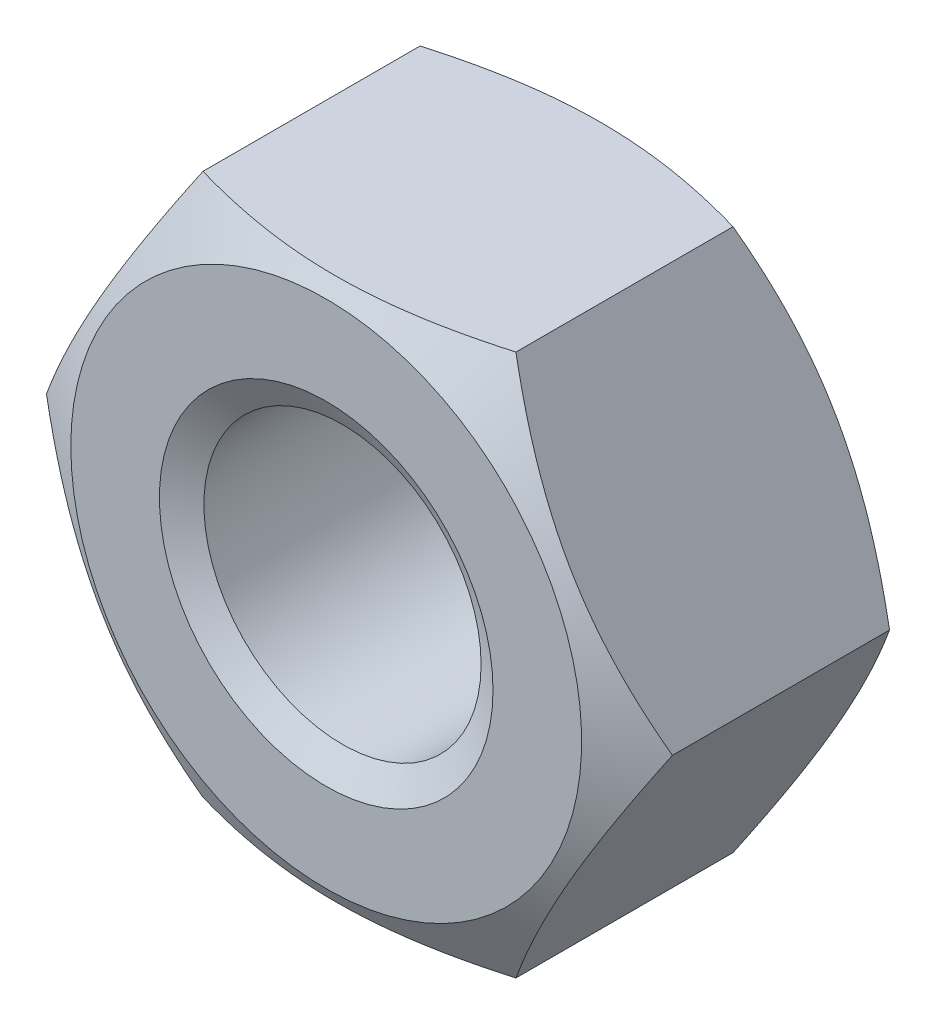
ISO-10303-21;
HEADER;
FILE_DESCRIPTION(('STEP AP214'),'2;1');
FILE_NAME('part.step','',(''),(''),'','','');
FILE_SCHEMA(('AUTOMOTIVE_DESIGN { 1 0 10303 214 1 1 1 1 }'));
ENDSEC;
DATA;
#1=APPLICATION_CONTEXT('core data for automotive mechanical design processes');
#2=APPLICATION_PROTOCOL_DEFINITION('international standard','automotive_design',2000,#1);
#3=PRODUCT_CONTEXT('',#1,'mechanical');
#4=PRODUCT('Part','Part','',(#3));
#5=PRODUCT_RELATED_PRODUCT_CATEGORY('part','',(#4));
#6=PRODUCT_DEFINITION_FORMATION('','',#4);
#7=PRODUCT_DEFINITION_CONTEXT('part definition',#1,'design');
#8=PRODUCT_DEFINITION('design','',#6,#7);
#9=PRODUCT_DEFINITION_SHAPE('','',#8);
#10=(LENGTH_UNIT() NAMED_UNIT(*) SI_UNIT(.MILLI.,.METRE.));
#11=(NAMED_UNIT(*) PLANE_ANGLE_UNIT() SI_UNIT($,.RADIAN.));
#12=(NAMED_UNIT(*) SI_UNIT($,.STERADIAN.) SOLID_ANGLE_UNIT());
#13=UNCERTAINTY_MEASURE_WITH_UNIT(LENGTH_MEASURE(1.E-05),#10,'distance_accuracy_value','');
#14=(GEOMETRIC_REPRESENTATION_CONTEXT(3) GLOBAL_UNCERTAINTY_ASSIGNED_CONTEXT((#13)) GLOBAL_UNIT_ASSIGNED_CONTEXT((#10,
#11,#12)) REPRESENTATION_CONTEXT('',''));
#15=CARTESIAN_POINT('',(0.,0.,0.));
#16=DIRECTION('',(0.,0.,1.));
#17=DIRECTION('',(1.,0.,0.));
#18=AXIS2_PLACEMENT_3D('',#15,#16,#17);
#19=CARTESIAN_POINT('',(3.75277674973258,-6.5,-6.8));
#20=DIRECTION('',(0.866025403784439,-0.5,0.));
#21=DIRECTION('',(0.5,0.866025403784439,0.));
#22=AXIS2_PLACEMENT_3D('',#19,#20,#21);
#23=PLANE('',#22);
#24=CARTESIAN_POINT('',(3.75266127967874,-6.5002,-0.797129602751971));
#25=CARTESIAN_POINT('',(3.83515161912751,-6.35732254094112,-0.74951077402159));
#26=CARTESIAN_POINT('',(3.91794952254313,-6.21391236546508,-0.704053051548811));
#27=CARTESIAN_POINT('',(4.08421773795795,-5.9259273686828,-0.618055032969151));
#28=CARTESIAN_POINT('',(4.16768832359106,-5.78135207342873,-0.577516858174131));
#29=CARTESIAN_POINT('',(4.41943655294052,-5.34531134947996,-0.464077352069315));
#30=CARTESIAN_POINT('',(4.5887079340369,-5.05212471715368,-0.399554158074847));
#31=CARTESIAN_POINT('',(4.84201947708216,-4.61337625445562,-0.3238929344936));
#32=CARTESIAN_POINT('',(4.92530276780317,-4.46912536350531,-0.302339207403096));
#33=CARTESIAN_POINT('',(5.09224566542478,-4.17997178286191,-0.266196665552228));
#34=CARTESIAN_POINT('',(5.17590523841628,-4.03506915190111,-0.251607235405776));
#35=CARTESIAN_POINT('',(5.34336968579964,-3.74501222057168,-0.229765103453457));
#36=CARTESIAN_POINT('',(5.42717428667601,-3.59985839394579,-0.222504075268218));
#37=CARTESIAN_POINT('',(5.59485627940484,-3.30942466302505,-0.215466653528341));
#38=CARTESIAN_POINT('',(5.67873366892861,-3.16414476276364,-0.215690028758315));
#39=CARTESIAN_POINT('',(5.90853103021318,-2.7661240575735,-0.226589809461276));
#40=CARTESIAN_POINT('',(6.05437578112764,-2.51351353897243,-0.244888168815523));
#41=CARTESIAN_POINT('',(6.34509659313135,-2.00997032176432,-0.302912692403784));
#42=CARTESIAN_POINT('',(6.48997163178545,-1.75903939406692,-0.342658689484354));
#43=CARTESIAN_POINT('',(6.78127752911039,-1.25448277935568,-0.442012254148258));
#44=CARTESIAN_POINT('',(6.92767163007068,-1.00092075856409,-0.502040776584135));
#45=CARTESIAN_POINT('',(7.21827667013277,-0.497578064240956,-0.638281343455976));
#46=CARTESIAN_POINT('',(7.36249133098589,-0.247790944447037,-0.7144613851097));
#47=CARTESIAN_POINT('',(7.50566896951898,0.000199999999998428,-0.797129602751974));
#48=B_SPLINE_CURVE_WITH_KNOTS('',3,(#24,#25,#26,#27,#28,#29,#30,#31,#32,#33,#34,#35,#36,#37,#38,
#39,#40,#41,#42,#43,#44,#45,#46,#47),.UNSPECIFIED.,.F.,.F.,(4,2,2,2,2,2,2,2,2,2,2,4),(0.,
0.515105052395588,1.03043143507524,2.06322554824262,2.56697389547996,3.07067772176453,
3.57380860368928,4.0769239424252,4.9527935470566,5.82947446853466,6.72559912449736,
7.61996451221045),.UNSPECIFIED.);
#49=CARTESIAN_POINT('',(3.75277674973257,-6.5,-0.797062934546865));
#50=VERTEX_POINT('',#49);
#51=CARTESIAN_POINT('',(7.50555349946514,0.,-0.797062934546865));
#52=VERTEX_POINT('',#51);
#53=EDGE_CURVE('E50',#50,#52,#48,.T.);
#54=ORIENTED_EDGE('',*,*,#53,.F.);
#55=DIRECTION('',(0.,0.,1.));
#56=VECTOR('',#55,1.);
#57=CARTESIAN_POINT('',(3.75277674973258,-6.5,-6.8));
#58=LINE('',#57,#56);
#59=CARTESIAN_POINT('',(3.75277674973257,-6.5,-6.00293706545314));
#60=VERTEX_POINT('',#59);
#61=EDGE_CURVE('E114',#60,#50,#58,.T.);
#62=ORIENTED_EDGE('',*,*,#61,.F.);
#63=CARTESIAN_POINT('',(7.50566896951898,0.000199999999998263,-6.00287039724803));
#64=CARTESIAN_POINT('',(7.4231786300702,-0.142677459058882,-6.05048922597841));
#65=CARTESIAN_POINT('',(7.34038072665459,-0.286087634534915,-6.09594694845119));
#66=CARTESIAN_POINT('',(7.17411251123976,-0.574072631317197,-6.18194496703085));
#67=CARTESIAN_POINT('',(7.09064192560665,-0.718647926571265,-6.22248314182587));
#68=CARTESIAN_POINT('',(6.83889369625719,-1.15468865052003,-6.33592264793068));
#69=CARTESIAN_POINT('',(6.66962231516081,-1.44787528284632,-6.40044584192515));
#70=CARTESIAN_POINT('',(6.41631077211556,-1.88662374554438,-6.4761070655064));
#71=CARTESIAN_POINT('',(6.33302748139455,-2.03087463649469,-6.4976607925969));
#72=CARTESIAN_POINT('',(6.16608458377294,-2.32002821713809,-6.53380333444777));
#73=CARTESIAN_POINT('',(6.08242501078143,-2.46493084809889,-6.54839276459422));
#74=CARTESIAN_POINT('',(5.91496056339807,-2.75498777942832,-6.57023489654654));
#75=CARTESIAN_POINT('',(5.83115596252171,-2.90014160605421,-6.57749592473178));
#76=CARTESIAN_POINT('',(5.66347396979287,-3.19057533697495,-6.58453334647166));
#77=CARTESIAN_POINT('',(5.57959658026911,-3.33585523723636,-6.58430997124169));
#78=CARTESIAN_POINT('',(5.34979921898454,-3.7338759424265,-6.57341019053872));
#79=CARTESIAN_POINT('',(5.20395446807007,-3.98648646102757,-6.55511183118448));
#80=CARTESIAN_POINT('',(4.91323365606636,-4.49002967823568,-6.49708730759622));
#81=CARTESIAN_POINT('',(4.76835861741226,-4.74096060593308,-6.45734131051565));
#82=CARTESIAN_POINT('',(4.47705272008732,-5.24551722064432,-6.35798774585174));
#83=CARTESIAN_POINT('',(4.33065861912703,-5.49907924143591,-6.29795922341587));
#84=CARTESIAN_POINT('',(4.04005357906494,-6.00242193575904,-6.16171865654403));
#85=CARTESIAN_POINT('',(3.89583891821182,-6.25220905555296,-6.0855386148903));
#86=CARTESIAN_POINT('',(3.75266127967874,-6.5002,-6.00287039724803));
#87=B_SPLINE_CURVE_WITH_KNOTS('',3,(#63,#64,#65,#66,#67,#68,#69,#70,#71,#72,#73,#74,#75,#76,#77,
#78,#79,#80,#81,#82,#83,#84,#85,#86),.UNSPECIFIED.,.F.,.F.,(4,2,2,2,2,2,2,2,2,2,2,4),(0.,
0.515105052395587,1.03043143507524,2.06322554824262,2.56697389547996,3.07067772176454,
3.57380860368928,4.0769239424252,4.9527935470566,5.82947446853466,6.72559912449736,
7.61996451221045),.UNSPECIFIED.);
#88=CARTESIAN_POINT('',(7.50555349946513,0.,-6.00293706545314));
#89=VERTEX_POINT('',#88);
#90=EDGE_CURVE('E125',#89,#60,#87,.T.);
#91=ORIENTED_EDGE('',*,*,#90,.F.);
#92=DIRECTION('',(0.,0.,1.));
#93=VECTOR('',#92,1.);
#94=CARTESIAN_POINT('',(7.50555349946514,0.,-6.8));
#95=LINE('',#94,#93);
#96=EDGE_CURVE('E122',#89,#52,#95,.T.);
#97=ORIENTED_EDGE('',*,*,#96,.T.);
#98=EDGE_LOOP('',(#54,#62,#91,#97));
#99=FACE_BOUND('',#98,.T.);
#100=ADVANCED_FACE('F35',(#99),#23,.T.);
#101=CARTESIAN_POINT('',(-3.75277674973256,-6.5,-6.8));
#102=DIRECTION('',(0.,-1.,0.));
#103=DIRECTION('',(1.,0.,0.));
#104=AXIS2_PLACEMENT_3D('',#101,#102,#103);
#105=PLANE('',#104);
#106=CARTESIAN_POINT('',(-9.92291866017417,-6.5,-3.31243543361797));
#107=CARTESIAN_POINT('',(-9.63776416855593,-6.5,-3.1747579013455));
#108=CARTESIAN_POINT('',(-9.35193207759096,-6.5,-3.03845822318955));
#109=CARTESIAN_POINT('',(-8.77854615913525,-6.5,-2.76940264110952));
#110=CARTESIAN_POINT('',(-8.49099204079674,-6.5,-2.63664735775047));
#111=CARTESIAN_POINT('',(-7.91222729165606,-6.5,-2.37476269409954));
#112=CARTESIAN_POINT('',(-7.6210051336142,-6.5,-2.24565869614066));
#113=CARTESIAN_POINT('',(-7.03615615427031,-6.5,-1.99303941600957));
#114=CARTESIAN_POINT('',(-6.74252946028315,-6.5,-1.86952384017355));
#115=CARTESIAN_POINT('',(-6.14889908012572,-6.5,-1.62815963107016));
#116=CARTESIAN_POINT('',(-5.84886102873999,-6.5,-1.51039504599784));
#117=CARTESIAN_POINT('',(-5.24523612314392,-6.5,-1.28416423039246));
#118=CARTESIAN_POINT('',(-4.94164887737799,-6.5,-1.17569903700337));
#119=CARTESIAN_POINT('',(-4.33107246379287,-6.5,-0.97100382042503));
#120=CARTESIAN_POINT('',(-4.02409220300225,-6.5,-0.87474752047321));
#121=CARTESIAN_POINT('',(-3.40578008080139,-6.5,-0.697613881846726));
#122=CARTESIAN_POINT('',(-3.094449636744,-6.5,-0.61673165397165));
#123=CARTESIAN_POINT('',(-2.46716042582185,-6.5,-0.474295122866958));
#124=CARTESIAN_POINT('',(-2.15120008528043,-6.5,-0.412747558730061));
#125=CARTESIAN_POINT('',(-1.67450484630629,-6.5,-0.338026109072159));
#126=CARTESIAN_POINT('',(-1.51512759997172,-6.5,-0.316050660213234));
#127=CARTESIAN_POINT('',(-1.19563647261904,-6.5,-0.278399300279482));
#128=CARTESIAN_POINT('',(-1.03552266604803,-6.5,-0.262722766108379));
#129=CARTESIAN_POINT('',(-0.715772890023888,-6.5,-0.238089616370639));
#130=CARTESIAN_POINT('',(-0.556140088232009,-6.5,-0.229092046252056));
#131=CARTESIAN_POINT('',(-0.23663719841188,-6.5,-0.217863943995715));
#132=CARTESIAN_POINT('',(-0.0767671139705783,-6.5,-0.215633310585428));
#133=CARTESIAN_POINT('',(0.242879029195939,-6.5,-0.217992094037744));
#134=CARTESIAN_POINT('',(0.402655101699244,-6.5,-0.222579622369509));
#135=CARTESIAN_POINT('',(0.721875807667276,-6.5,-0.238461502899183));
#136=CARTESIAN_POINT('',(0.881320422757077,-6.5,-0.249756217469733));
#137=CARTESIAN_POINT('',(1.26861535226623,-6.5,-0.285103215564347));
#138=CARTESIAN_POINT('',(1.49616063368138,-6.5,-0.312563194956847));
#139=CARTESIAN_POINT('',(1.94944838674173,-6.5,-0.379607238511707));
#140=CARTESIAN_POINT('',(2.17519058178562,-6.5,-0.419193127532789));
#141=CARTESIAN_POINT('',(2.85011634871387,-6.5,-0.554151961472067));
#142=CARTESIAN_POINT('',(3.29611473545063,-6.5,-0.665635140334114));
#143=CARTESIAN_POINT('',(3.96319486644495,-6.5,-0.857611485992482));
#144=CARTESIAN_POINT('',(4.18776829077904,-6.5,-0.926658091572186));
#145=CARTESIAN_POINT('',(4.63474566320674,-6.5,-1.07157381717339));
#146=CARTESIAN_POINT('',(4.85714941487105,-6.5,-1.1474435486816));
#147=CARTESIAN_POINT('',(5.29867675759233,-6.5,-1.30438448670166));
#148=CARTESIAN_POINT('',(5.51781178769664,-6.5,-1.38542383681878));
#149=CARTESIAN_POINT('',(5.95422124026874,-6.5,-1.55215593772445));
#150=CARTESIAN_POINT('',(6.17149627847268,-6.5,-1.6378470736946));
#151=CARTESIAN_POINT('',(6.38798886562027,-6.5,-1.72542773481033));
#152=B_SPLINE_CURVE_WITH_KNOTS('',3,(#106,#107,#108,#109,#110,#111,#112,#113,#114,#115,#116,
#117,#118,#119,#120,#121,#122,#123,#124,#125,#126,#127,#128,#129,#130,#131,#132,#133,#134,#135,
#136,#137,#138,#139,#140,#141,#142,#143,#144,#145,#146,#147,#148,#149,#150,#151),.UNSPECIFIED.,
.F.,.F.,(4,2,2,2,2,2,2,2,2,2,2,2,2,2,2,2,2,2,2,2,2,2,4),(0.,0.949967476135232,1.90010019944756,
2.85572275137756,3.81129502820754,4.77814082687146,5.7450943161716,6.70993001701518,
7.67445836945776,8.63932253598788,9.12187297546124,9.60437566870126,10.0838947076068,
10.5634065700974,11.0427856395828,11.5221906110874,12.2093882021175,12.8966892620971,
14.2739466296966,14.97873729655,15.6835911896167,16.3844572945309,17.0850816379249),.UNSPECIFIED.);
#153=CARTESIAN_POINT('',(-3.75277674973256,-6.5,-0.797062934546865));
#154=VERTEX_POINT('',#153);
#155=EDGE_CURVE('E107',#154,#50,#152,.T.);
#156=ORIENTED_EDGE('',*,*,#155,.F.);
#157=DIRECTION('',(0.,0.,1.));
#158=VECTOR('',#157,1.);
#159=CARTESIAN_POINT('',(-3.75277674973256,-6.5,-6.8));
#160=LINE('',#159,#158);
#161=CARTESIAN_POINT('',(-3.75277674973256,-6.5,-6.00293706545314));
#162=VERTEX_POINT('',#161);
#163=EDGE_CURVE('E106',#162,#154,#160,.T.);
#164=ORIENTED_EDGE('',*,*,#163,.F.);
#165=CARTESIAN_POINT('',(-9.92291866017417,-6.5,-3.48756456638204));
#166=CARTESIAN_POINT('',(-9.63776416855593,-6.5,-3.62524209865451));
#167=CARTESIAN_POINT('',(-9.35193207759096,-6.5,-3.76154177681046));
#168=CARTESIAN_POINT('',(-8.77854615913525,-6.5,-4.03059735889049));
#169=CARTESIAN_POINT('',(-8.49099204079674,-6.5,-4.16335264224954));
#170=CARTESIAN_POINT('',(-7.91222729165605,-6.5,-4.42523730590046));
#171=CARTESIAN_POINT('',(-7.6210051336142,-6.5,-4.55434130385935));
#172=CARTESIAN_POINT('',(-7.03615615427031,-6.5,-4.80696058399043));
#173=CARTESIAN_POINT('',(-6.74252946028314,-6.5,-4.93047615982646));
#174=CARTESIAN_POINT('',(-6.14889908012572,-6.5,-5.17184036892985));
#175=CARTESIAN_POINT('',(-5.84886102873999,-6.5,-5.28960495400216));
#176=CARTESIAN_POINT('',(-5.24523612314392,-6.5,-5.51583576960755));
#177=CARTESIAN_POINT('',(-4.94164887737798,-6.5,-5.62430096299663));
#178=CARTESIAN_POINT('',(-4.33107246379286,-6.5,-5.82899617957497));
#179=CARTESIAN_POINT('',(-4.02409220300225,-6.5,-5.92525247952679));
#180=CARTESIAN_POINT('',(-3.40578008080139,-6.5,-6.10238611815328));
#181=CARTESIAN_POINT('',(-3.094449636744,-6.5,-6.18326834602835));
#182=CARTESIAN_POINT('',(-2.46716042582185,-6.5,-6.32570487713304));
#183=CARTESIAN_POINT('',(-2.15120008528043,-6.5,-6.38725244126994));
#184=CARTESIAN_POINT('',(-1.67450484630629,-6.5,-6.46197389092784));
#185=CARTESIAN_POINT('',(-1.51512759997172,-6.5,-6.48394933978677));
#186=CARTESIAN_POINT('',(-1.19563647261904,-6.5,-6.52160069972052));
#187=CARTESIAN_POINT('',(-1.03552266604803,-6.5,-6.53727723389162));
#188=CARTESIAN_POINT('',(-0.71577289002389,-6.5,-6.56191038362936));
#189=CARTESIAN_POINT('',(-0.556140088232011,-6.5,-6.57090795374794));
#190=CARTESIAN_POINT('',(-0.236637198411883,-6.5,-6.58213605600428));
#191=CARTESIAN_POINT('',(-0.0767671139705817,-6.5,-6.58436668941457));
#192=CARTESIAN_POINT('',(0.242879029195936,-6.5,-6.58200790596226));
#193=CARTESIAN_POINT('',(0.402655101699242,-6.5,-6.57742037763049));
#194=CARTESIAN_POINT('',(0.721875807667274,-6.5,-6.56153849710082));
#195=CARTESIAN_POINT('',(0.881320422757075,-6.5,-6.55024378253027));
#196=CARTESIAN_POINT('',(1.26861535226623,-6.5,-6.51489678443565));
#197=CARTESIAN_POINT('',(1.49616063368137,-6.5,-6.48743680504315));
#198=CARTESIAN_POINT('',(1.94944838674173,-6.5,-6.42039276148829));
#199=CARTESIAN_POINT('',(2.17519058178562,-6.5,-6.38080687246721));
#200=CARTESIAN_POINT('',(2.85011634871387,-6.5,-6.24584803852793));
#201=CARTESIAN_POINT('',(3.29611473545063,-6.5,-6.13436485966588));
#202=CARTESIAN_POINT('',(3.96319486644495,-6.5,-5.94238851400752));
#203=CARTESIAN_POINT('',(4.18776829077904,-6.5,-5.87334190842782));
#204=CARTESIAN_POINT('',(4.63474566320675,-6.5,-5.72842618282661));
#205=CARTESIAN_POINT('',(4.85714941487105,-6.5,-5.6525564513184));
#206=CARTESIAN_POINT('',(5.29867675759233,-6.5,-5.49561551329834));
#207=CARTESIAN_POINT('',(5.51781178769664,-6.5,-5.41457616318122));
#208=CARTESIAN_POINT('',(5.95422124026875,-6.5,-5.24784406227555));
#209=CARTESIAN_POINT('',(6.17149627847269,-6.5,-5.1621529263054));
#210=CARTESIAN_POINT('',(6.38798886562028,-6.5,-5.07457226518967));
#211=B_SPLINE_CURVE_WITH_KNOTS('',3,(#165,#166,#167,#168,#169,#170,#171,#172,#173,#174,#175,
#176,#177,#178,#179,#180,#181,#182,#183,#184,#185,#186,#187,#188,#189,#190,#191,#192,#193,#194,
#195,#196,#197,#198,#199,#200,#201,#202,#203,#204,#205,#206,#207,#208,#209,#210),.UNSPECIFIED.,
.F.,.F.,(4,2,2,2,2,2,2,2,2,2,2,2,2,2,2,2,2,2,2,2,2,2,4),(0.,0.949967476135235,1.90010019944756,
2.85572275137756,3.81129502820754,4.77814082687146,5.7450943161716,6.70993001701518,
7.67445836945776,8.63932253598787,9.12187297546124,9.60437566870125,10.0838947076068,
10.5634065700974,11.0427856395828,11.5221906110874,12.2093882021175,12.8966892620971,
14.2739466296966,14.97873729655,15.6835911896167,16.3844572945309,17.0850816379249),.UNSPECIFIED.);
#212=EDGE_CURVE('E196',#60,#162,#211,.F.);
#213=ORIENTED_EDGE('',*,*,#212,.F.);
#214=ORIENTED_EDGE('',*,*,#61,.T.);
#215=EDGE_LOOP('',(#156,#164,#213,#214));
#216=FACE_BOUND('',#215,.T.);
#217=ADVANCED_FACE('F204',(#216),#105,.T.);
#218=CARTESIAN_POINT('',(-7.50555349946513,0.,-6.8));
#219=DIRECTION('',(-0.866025403784439,-0.5,0.));
#220=DIRECTION('',(0.5,-0.866025403784439,0.));
#221=AXIS2_PLACEMENT_3D('',#218,#219,#220);
#222=PLANE('',#221);
#223=CARTESIAN_POINT('',(-7.50566896951897,0.000200000000004401,-0.797129602751969));
#224=CARTESIAN_POINT('',(-7.4231786300702,-0.142677459058876,-0.749510774021588));
#225=CARTESIAN_POINT('',(-7.34038072665458,-0.286087634534908,-0.704053051548808));
#226=CARTESIAN_POINT('',(-7.17411251123975,-0.57407263131719,-0.618055032969148));
#227=CARTESIAN_POINT('',(-7.09064192560665,-0.718647926571259,-0.577516858174128));
#228=CARTESIAN_POINT('',(-6.83889369625718,-1.15468865052003,-0.464077352069312));
#229=CARTESIAN_POINT('',(-6.6696223151608,-1.44787528284631,-0.399554158074843));
#230=CARTESIAN_POINT('',(-6.41631077211555,-1.88662374554437,-0.323892934493596));
#231=CARTESIAN_POINT('',(-6.33302748139454,-2.03087463649468,-0.302339207403092));
#232=CARTESIAN_POINT('',(-6.16608458377293,-2.32002821713808,-0.266196665552224));
#233=CARTESIAN_POINT('',(-6.08242501078143,-2.46493084809888,-0.251607235405771));
#234=CARTESIAN_POINT('',(-5.91496056339806,-2.75498777942831,-0.229765103453451));
#235=CARTESIAN_POINT('',(-5.8311559625217,-2.9001416060542,-0.222504075268212));
#236=CARTESIAN_POINT('',(-5.66347396979287,-3.19057533697494,-0.215466653528336));
#237=CARTESIAN_POINT('',(-5.5795965802691,-3.33585523723635,-0.215690028758309));
#238=CARTESIAN_POINT('',(-5.34979921898453,-3.73387594242649,-0.22658980946127));
#239=CARTESIAN_POINT('',(-5.20395446807007,-3.98648646102756,-0.244888168815517));
#240=CARTESIAN_POINT('',(-4.91323365606635,-4.49002967823567,-0.302912692403778));
#241=CARTESIAN_POINT('',(-4.76835861741226,-4.74096060593308,-0.342658689484347));
#242=CARTESIAN_POINT('',(-4.47705272008731,-5.24551722064432,-0.442012254148252));
#243=CARTESIAN_POINT('',(-4.33065861912702,-5.49907924143591,-0.502040776584128));
#244=CARTESIAN_POINT('',(-4.04005357906493,-6.00242193575904,-0.63828134345597));
#245=CARTESIAN_POINT('',(-3.89583891821181,-6.25220905555296,-0.714461385109694));
#246=CARTESIAN_POINT('',(-3.75266127967872,-6.5002,-0.797129602751968));
#247=B_SPLINE_CURVE_WITH_KNOTS('',3,(#223,#224,#225,#226,#227,#228,#229,#230,#231,#232,#233,
#234,#235,#236,#237,#238,#239,#240,#241,#242,#243,#244,#245,#246),.UNSPECIFIED.,.F.,.F.,(4,2,2,
2,2,2,2,2,2,2,2,4),(0.,0.515105052395587,1.03043143507524,2.06322554824262,2.56697389547996,
3.07067772176453,3.57380860368927,4.0769239424252,4.9527935470566,5.82947446853466,
6.72559912449736,7.61996451221046),.UNSPECIFIED.);
#248=CARTESIAN_POINT('',(-7.50555349946513,0.,-0.797062934546865));
#249=VERTEX_POINT('',#248);
#250=EDGE_CURVE('E90',#249,#154,#247,.T.);
#251=ORIENTED_EDGE('',*,*,#250,.F.);
#252=DIRECTION('',(0.,0.,1.));
#253=VECTOR('',#252,1.);
#254=CARTESIAN_POINT('',(-7.50555349946513,0.,-6.8));
#255=LINE('',#254,#253);
#256=CARTESIAN_POINT('',(-7.50555349946513,0.,-6.00293706545314));
#257=VERTEX_POINT('',#256);
#258=EDGE_CURVE('E104',#257,#249,#255,.T.);
#259=ORIENTED_EDGE('',*,*,#258,.F.);
#260=CARTESIAN_POINT('',(-3.75266127967872,-6.5002,-6.00287039724803));
#261=CARTESIAN_POINT('',(-3.8351516191275,-6.35732254094112,-6.05048922597841));
#262=CARTESIAN_POINT('',(-3.91794952254312,-6.21391236546509,-6.09594694845119));
#263=CARTESIAN_POINT('',(-4.08421773795794,-5.9259273686828,-6.18194496703085));
#264=CARTESIAN_POINT('',(-4.16768832359105,-5.78135207342874,-6.22248314182587));
#265=CARTESIAN_POINT('',(-4.41943655294051,-5.34531134947997,-6.33592264793069));
#266=CARTESIAN_POINT('',(-4.58870793403689,-5.05212471715368,-6.40044584192516));
#267=CARTESIAN_POINT('',(-4.84201947708214,-4.61337625445563,-6.4761070655064));
#268=CARTESIAN_POINT('',(-4.92530276780315,-4.46912536350531,-6.49766079259691));
#269=CARTESIAN_POINT('',(-5.09224566542476,-4.17997178286191,-6.53380333444778));
#270=CARTESIAN_POINT('',(-5.17590523841627,-4.03506915190111,-6.54839276459423));
#271=CARTESIAN_POINT('',(-5.34336968579963,-3.74501222057168,-6.57023489654655));
#272=CARTESIAN_POINT('',(-5.42717428667599,-3.59985839394579,-6.57749592473179));
#273=CARTESIAN_POINT('',(-5.59485627940483,-3.30942466302505,-6.58453334647166));
#274=CARTESIAN_POINT('',(-5.67873366892859,-3.16414476276365,-6.58430997124169));
#275=CARTESIAN_POINT('',(-5.90853103021316,-2.76612405757351,-6.57341019053873));
#276=CARTESIAN_POINT('',(-6.05437578112763,-2.51351353897243,-6.55511183118448));
#277=CARTESIAN_POINT('',(-6.34509659313134,-2.00997032176432,-6.49708730759622));
#278=CARTESIAN_POINT('',(-6.48997163178544,-1.75903939406692,-6.45734131051565));
#279=CARTESIAN_POINT('',(-6.78127752911038,-1.25448277935568,-6.35798774585175));
#280=CARTESIAN_POINT('',(-6.92767163007067,-1.00092075856408,-6.29795922341587));
#281=CARTESIAN_POINT('',(-7.21827667013276,-0.497578064240951,-6.16171865654403));
#282=CARTESIAN_POINT('',(-7.36249133098588,-0.247790944447032,-6.08553861489031));
#283=CARTESIAN_POINT('',(-7.50566896951897,0.00020000000000446,-6.00287039724803));
#284=B_SPLINE_CURVE_WITH_KNOTS('',3,(#260,#261,#262,#263,#264,#265,#266,#267,#268,#269,#270,
#271,#272,#273,#274,#275,#276,#277,#278,#279,#280,#281,#282,#283),.UNSPECIFIED.,.F.,.F.,(4,2,2,
2,2,2,2,2,2,2,2,4),(0.,0.515105052395587,1.03043143507524,2.06322554824262,2.56697389547996,
3.07067772176453,3.57380860368927,4.07692394242519,4.9527935470566,5.82947446853466,
6.72559912449736,7.61996451221046),.UNSPECIFIED.);
#285=EDGE_CURVE('E190',#162,#257,#284,.T.);
#286=ORIENTED_EDGE('',*,*,#285,.F.);
#287=ORIENTED_EDGE('',*,*,#163,.T.);
#288=EDGE_LOOP('',(#251,#259,#286,#287));
#289=FACE_BOUND('',#288,.T.);
#290=ADVANCED_FACE('F102',(#289),#222,.T.);
#291=CARTESIAN_POINT('',(-3.75277674973257,6.5,-6.8));
#292=DIRECTION('',(-0.866025403784439,0.5,0.));
#293=DIRECTION('',(-0.5,-0.866025403784439,0.));
#294=AXIS2_PLACEMENT_3D('',#291,#292,#293);
#295=PLANE('',#294);
#296=CARTESIAN_POINT('',(-3.75266127967873,6.5002,-0.797129602751971));
#297=CARTESIAN_POINT('',(-3.8351516191275,6.35732254094112,-0.74951077402159));
#298=CARTESIAN_POINT('',(-3.91794952254312,6.21391236546509,-0.704053051548811));
#299=CARTESIAN_POINT('',(-4.08421773795794,5.92592736868281,-0.618055032969151));
#300=CARTESIAN_POINT('',(-4.16768832359105,5.78135207342874,-0.57751685817413));
#301=CARTESIAN_POINT('',(-4.41943655294051,5.34531134947997,-0.464077352069314));
#302=CARTESIAN_POINT('',(-4.58870793403689,5.05212471715368,-0.399554158074845));
#303=CARTESIAN_POINT('',(-4.84201947708215,4.61337625445563,-0.323892934493598));
#304=CARTESIAN_POINT('',(-4.92530276780316,4.46912536350531,-0.302339207403094));
#305=CARTESIAN_POINT('',(-5.09224566542477,4.17997178286191,-0.266196665552226));
#306=CARTESIAN_POINT('',(-5.17590523841627,4.03506915190111,-0.251607235405773));
#307=CARTESIAN_POINT('',(-5.34336968579963,3.74501222057168,-0.229765103453454));
#308=CARTESIAN_POINT('',(-5.427174286676,3.59985839394579,-0.222504075268215));
#309=CARTESIAN_POINT('',(-5.59485627940483,3.30942466302505,-0.215466653528339));
#310=CARTESIAN_POINT('',(-5.6787336689286,3.16414476276365,-0.215690028758312));
#311=CARTESIAN_POINT('',(-5.90853103021317,2.76612405757351,-0.226589809461272));
#312=CARTESIAN_POINT('',(-6.05437578112763,2.51351353897243,-0.24488816881552));
#313=CARTESIAN_POINT('',(-6.34509659313134,2.00997032176432,-0.302912692403781));
#314=CARTESIAN_POINT('',(-6.48997163178544,1.75903939406692,-0.34265868948435));
#315=CARTESIAN_POINT('',(-6.78127752911038,1.25448277935568,-0.442012254148254));
#316=CARTESIAN_POINT('',(-6.92767163007067,1.00092075856409,-0.50204077658413));
#317=CARTESIAN_POINT('',(-7.21827667013276,0.49757806424096,-0.638281343455971));
#318=CARTESIAN_POINT('',(-7.36249133098588,0.247790944447041,-0.714461385109695));
#319=CARTESIAN_POINT('',(-7.50566896951897,-0.000199999999994619,-0.797129602751969));
#320=B_SPLINE_CURVE_WITH_KNOTS('',3,(#296,#297,#298,#299,#300,#301,#302,#303,#304,#305,#306,
#307,#308,#309,#310,#311,#312,#313,#314,#315,#316,#317,#318,#319),.UNSPECIFIED.,.F.,.F.,(4,2,2,
2,2,2,2,2,2,2,2,4),(0.,0.515105052395587,1.03043143507524,2.06322554824262,2.56697389547996,
3.07067772176454,3.57380860368928,4.0769239424252,4.9527935470566,5.82947446853466,
6.72559912449736,7.61996451221045),.UNSPECIFIED.);
#321=CARTESIAN_POINT('',(-3.75277674973256,6.5,-0.797062934546865));
#322=VERTEX_POINT('',#321);
#323=EDGE_CURVE('E86',#322,#249,#320,.T.);
#324=ORIENTED_EDGE('',*,*,#323,.F.);
#325=DIRECTION('',(0.,0.,1.));
#326=VECTOR('',#325,1.);
#327=CARTESIAN_POINT('',(-3.75277674973257,6.5,-6.8));
#328=LINE('',#327,#326);
#329=CARTESIAN_POINT('',(-3.75277674973256,6.5,-6.00293706545314));
#330=VERTEX_POINT('',#329);
#331=EDGE_CURVE('E112',#330,#322,#328,.T.);
#332=ORIENTED_EDGE('',*,*,#331,.F.);
#333=CARTESIAN_POINT('',(-7.50566896951897,-0.000199999999995666,-6.00287039724803));
#334=CARTESIAN_POINT('',(-7.4231786300702,0.142677459058885,-6.05048922597841));
#335=CARTESIAN_POINT('',(-7.34038072665458,0.286087634534917,-6.09594694845119));
#336=CARTESIAN_POINT('',(-7.17411251123975,0.574072631317199,-6.18194496703085));
#337=CARTESIAN_POINT('',(-7.09064192560665,0.718647926571268,-6.22248314182587));
#338=CARTESIAN_POINT('',(-6.83889369625719,1.15468865052004,-6.33592264793069));
#339=CARTESIAN_POINT('',(-6.6696223151608,1.44787528284632,-6.40044584192516));
#340=CARTESIAN_POINT('',(-6.41631077211555,1.88662374554438,-6.4761070655064));
#341=CARTESIAN_POINT('',(-6.33302748139454,2.03087463649469,-6.49766079259691));
#342=CARTESIAN_POINT('',(-6.16608458377293,2.32002821713809,-6.53380333444777));
#343=CARTESIAN_POINT('',(-6.08242501078143,2.46493084809889,-6.54839276459423));
#344=CARTESIAN_POINT('',(-5.91496056339806,2.75498777942832,-6.57023489654655));
#345=CARTESIAN_POINT('',(-5.8311559625217,2.90014160605421,-6.57749592473179));
#346=CARTESIAN_POINT('',(-5.66347396979287,3.19057533697495,-6.58453334647166));
#347=CARTESIAN_POINT('',(-5.5795965802691,3.33585523723636,-6.58430997124169));
#348=CARTESIAN_POINT('',(-5.34979921898453,3.73387594242649,-6.57341019053873));
#349=CARTESIAN_POINT('',(-5.20395446807007,3.98648646102757,-6.55511183118448));
#350=CARTESIAN_POINT('',(-4.91323365606635,4.49002967823568,-6.49708730759622));
#351=CARTESIAN_POINT('',(-4.76835861741226,4.74096060593308,-6.45734131051565));
#352=CARTESIAN_POINT('',(-4.47705272008732,5.24551722064432,-6.35798774585175));
#353=CARTESIAN_POINT('',(-4.33065861912702,5.49907924143591,-6.29795922341587));
#354=CARTESIAN_POINT('',(-4.04005357906493,6.00242193575905,-6.16171865654403));
#355=CARTESIAN_POINT('',(-3.89583891821181,6.25220905555297,-6.0855386148903));
#356=CARTESIAN_POINT('',(-3.75266127967873,6.5002,-6.00287039724803));
#357=B_SPLINE_CURVE_WITH_KNOTS('',3,(#333,#334,#335,#336,#337,#338,#339,#340,#341,#342,#343,
#344,#345,#346,#347,#348,#349,#350,#351,#352,#353,#354,#355,#356),.UNSPECIFIED.,.F.,.F.,(4,2,2,
2,2,2,2,2,2,2,2,4),(0.,0.515105052395587,1.03043143507524,2.06322554824262,2.56697389547996,
3.07067772176453,3.57380860368927,4.07692394242519,4.9527935470566,5.82947446853466,
6.72559912449736,7.61996451221045),.UNSPECIFIED.);
#358=EDGE_CURVE('E111',#257,#330,#357,.T.);
#359=ORIENTED_EDGE('',*,*,#358,.F.);
#360=ORIENTED_EDGE('',*,*,#258,.T.);
#361=EDGE_LOOP('',(#324,#332,#359,#360));
#362=FACE_BOUND('',#361,.T.);
#363=ADVANCED_FACE('F110',(#362),#295,.T.);
#364=CARTESIAN_POINT('',(3.75277674973257,6.5,-6.8));
#365=DIRECTION('',(0.,1.,0.));
#366=DIRECTION('',(0.,0.,1.));
#367=AXIS2_PLACEMENT_3D('',#364,#365,#366);
#368=PLANE('',#367);
#369=CARTESIAN_POINT('',(-9.92291866017418,6.5,-3.31243543361797));
#370=CARTESIAN_POINT('',(-9.63776416855594,6.5,-3.1747579013455));
#371=CARTESIAN_POINT('',(-9.35193207759097,6.5,-3.03845822318955));
#372=CARTESIAN_POINT('',(-8.77854615913526,6.5,-2.76940264110952));
#373=CARTESIAN_POINT('',(-8.49099204079675,6.5,-2.63664735775047));
#374=CARTESIAN_POINT('',(-7.91222729165607,6.5,-2.37476269409955));
#375=CARTESIAN_POINT('',(-7.62100513361421,6.5,-2.24565869614066));
#376=CARTESIAN_POINT('',(-7.03615615427032,6.5,-1.99303941600957));
#377=CARTESIAN_POINT('',(-6.74252946028315,6.5,-1.86952384017355));
#378=CARTESIAN_POINT('',(-6.14889908012573,6.5,-1.62815963107016));
#379=CARTESIAN_POINT('',(-5.84886102873999,6.5,-1.51039504599784));
#380=CARTESIAN_POINT('',(-5.24523612314393,6.5,-1.28416423039246));
#381=CARTESIAN_POINT('',(-4.94164887737799,6.5,-1.17569903700337));
#382=CARTESIAN_POINT('',(-4.33107246379287,6.5,-0.971003820425034));
#383=CARTESIAN_POINT('',(-4.02409220300226,6.5,-0.874747520473213));
#384=CARTESIAN_POINT('',(-3.40578008080139,6.5,-0.697613881846729));
#385=CARTESIAN_POINT('',(-3.09444963674401,6.5,-0.616731653971654));
#386=CARTESIAN_POINT('',(-2.46716042582185,6.5,-0.474295122866961));
#387=CARTESIAN_POINT('',(-2.15120008528043,6.5,-0.412747558730063));
#388=CARTESIAN_POINT('',(-1.6745048463063,6.5,-0.338026109072162));
#389=CARTESIAN_POINT('',(-1.51512759997172,6.5,-0.316050660213236));
#390=CARTESIAN_POINT('',(-1.19563647261904,6.5,-0.278399300279485));
#391=CARTESIAN_POINT('',(-1.03552266604803,6.5,-0.26272276610838));
#392=CARTESIAN_POINT('',(-0.715772890023889,6.5,-0.238089616370641));
#393=CARTESIAN_POINT('',(-0.556140088232009,6.5,-0.229092046252058));
#394=CARTESIAN_POINT('',(-0.236637198411881,6.5,-0.217863943995718));
#395=CARTESIAN_POINT('',(-0.0767671139705791,6.5,-0.21563331058543));
#396=CARTESIAN_POINT('',(0.242879029195938,6.5,-0.217992094037747));
#397=CARTESIAN_POINT('',(0.402655101699243,6.5,-0.222579622369512));
#398=CARTESIAN_POINT('',(0.721875807667275,6.5,-0.238461502899185));
#399=CARTESIAN_POINT('',(0.881320422757076,6.5,-0.249756217469736));
#400=CARTESIAN_POINT('',(1.26861535226623,6.5,-0.28510321556435));
#401=CARTESIAN_POINT('',(1.49616063368138,6.5,-0.312563194956849));
#402=CARTESIAN_POINT('',(1.94944838674173,6.5,-0.37960723851171));
#403=CARTESIAN_POINT('',(2.17519058178562,6.5,-0.419193127532792));
#404=CARTESIAN_POINT('',(2.85011634871386,6.5,-0.554151961472069));
#405=CARTESIAN_POINT('',(3.29611473545063,6.5,-0.665635140334115));
#406=CARTESIAN_POINT('',(3.96319486644494,6.5,-0.857611485992484));
#407=CARTESIAN_POINT('',(4.18776829077903,6.5,-0.926658091572188));
#408=CARTESIAN_POINT('',(4.63474566320674,6.5,-1.07157381717339));
#409=CARTESIAN_POINT('',(4.85714941487105,6.5,-1.1474435486816));
#410=CARTESIAN_POINT('',(5.29867675759232,6.5,-1.30438448670166));
#411=CARTESIAN_POINT('',(5.51781178769664,6.5,-1.38542383681878));
#412=CARTESIAN_POINT('',(5.95422124026874,6.5,-1.55215593772445));
#413=CARTESIAN_POINT('',(6.17149627847268,6.5,-1.6378470736946));
#414=CARTESIAN_POINT('',(6.38798886562027,6.5,-1.72542773481034));
#415=B_SPLINE_CURVE_WITH_KNOTS('',3,(#369,#370,#371,#372,#373,#374,#375,#376,#377,#378,#379,
#380,#381,#382,#383,#384,#385,#386,#387,#388,#389,#390,#391,#392,#393,#394,#395,#396,#397,#398,
#399,#400,#401,#402,#403,#404,#405,#406,#407,#408,#409,#410,#411,#412,#413,#414),.UNSPECIFIED.,
.F.,.F.,(4,2,2,2,2,2,2,2,2,2,2,2,2,2,2,2,2,2,2,2,2,2,4),(0.,0.949967476135234,1.90010019944756,
2.85572275137756,3.81129502820754,4.77814082687146,5.7450943161716,6.70993001701518,
7.67445836945777,8.63932253598789,9.12187297546125,9.60437566870126,10.0838947076068,
10.5634065700974,11.0427856395828,11.5221906110874,12.2093882021175,12.8966892620972,
14.2739466296966,14.97873729655,15.6835911896167,16.3844572945309,17.0850816379249),.UNSPECIFIED.);
#416=CARTESIAN_POINT('',(3.75277674973257,6.5,-0.797062934546865));
#417=VERTEX_POINT('',#416);
#418=EDGE_CURVE('E93',#417,#322,#415,.F.);
#419=ORIENTED_EDGE('',*,*,#418,.F.);
#420=DIRECTION('',(0.,0.,1.));
#421=VECTOR('',#420,1.);
#422=CARTESIAN_POINT('',(3.75277674973257,6.5,-6.8));
#423=LINE('',#422,#421);
#424=CARTESIAN_POINT('',(3.75277674973257,6.5,-6.00293706545313));
#425=VERTEX_POINT('',#424);
#426=EDGE_CURVE('E116',#425,#417,#423,.T.);
#427=ORIENTED_EDGE('',*,*,#426,.F.);
#428=CARTESIAN_POINT('',(-9.92291866017418,6.5,-3.48756456638204));
#429=CARTESIAN_POINT('',(-9.63776416855594,6.5,-3.6252420986545));
#430=CARTESIAN_POINT('',(-9.35193207759097,6.5,-3.76154177681045));
#431=CARTESIAN_POINT('',(-8.77854615913525,6.5,-4.03059735889048));
#432=CARTESIAN_POINT('',(-8.49099204079675,6.5,-4.16335264224953));
#433=CARTESIAN_POINT('',(-7.91222729165606,6.5,-4.42523730590046));
#434=CARTESIAN_POINT('',(-7.62100513361421,6.5,-4.55434130385934));
#435=CARTESIAN_POINT('',(-7.03615615427032,6.5,-4.80696058399043));
#436=CARTESIAN_POINT('',(-6.74252946028315,6.5,-4.93047615982645));
#437=CARTESIAN_POINT('',(-6.14889908012572,6.5,-5.17184036892984));
#438=CARTESIAN_POINT('',(-5.84886102873999,6.5,-5.28960495400216));
#439=CARTESIAN_POINT('',(-5.24523612314393,6.5,-5.51583576960754));
#440=CARTESIAN_POINT('',(-4.94164887737799,6.5,-5.62430096299663));
#441=CARTESIAN_POINT('',(-4.33107246379287,6.5,-5.82899617957497));
#442=CARTESIAN_POINT('',(-4.02409220300226,6.5,-5.92525247952679));
#443=CARTESIAN_POINT('',(-3.40578008080139,6.5,-6.10238611815327));
#444=CARTESIAN_POINT('',(-3.09444963674401,6.5,-6.18326834602835));
#445=CARTESIAN_POINT('',(-2.46716042582185,6.5,-6.32570487713304));
#446=CARTESIAN_POINT('',(-2.15120008528043,6.5,-6.38725244126994));
#447=CARTESIAN_POINT('',(-1.67450484630629,6.5,-6.46197389092784));
#448=CARTESIAN_POINT('',(-1.51512759997172,6.5,-6.48394933978676));
#449=CARTESIAN_POINT('',(-1.19563647261904,6.5,-6.52160069972052));
#450=CARTESIAN_POINT('',(-1.03552266604803,6.5,-6.53727723389162));
#451=CARTESIAN_POINT('',(-0.715772890023891,6.5,-6.56191038362936));
#452=CARTESIAN_POINT('',(-0.556140088232011,6.5,-6.57090795374794));
#453=CARTESIAN_POINT('',(-0.236637198411883,6.5,-6.58213605600428));
#454=CARTESIAN_POINT('',(-0.0767671139705811,6.5,-6.58436668941457));
#455=CARTESIAN_POINT('',(0.242879029195937,6.5,-6.58200790596225));
#456=CARTESIAN_POINT('',(0.402655101699242,6.5,-6.57742037763049));
#457=CARTESIAN_POINT('',(0.721875807667275,6.5,-6.56153849710082));
#458=CARTESIAN_POINT('',(0.881320422757075,6.5,-6.55024378253026));
#459=CARTESIAN_POINT('',(1.26861535226623,6.5,-6.51489678443565));
#460=CARTESIAN_POINT('',(1.49616063368138,6.5,-6.48743680504315));
#461=CARTESIAN_POINT('',(1.94944838674173,6.5,-6.42039276148829));
#462=CARTESIAN_POINT('',(2.17519058178563,6.5,-6.38080687246721));
#463=CARTESIAN_POINT('',(2.85011634871387,6.5,-6.24584803852793));
#464=CARTESIAN_POINT('',(3.29611473545064,6.5,-6.13436485966588));
#465=CARTESIAN_POINT('',(3.96319486644495,6.5,-5.94238851400751));
#466=CARTESIAN_POINT('',(4.18776829077905,6.5,-5.87334190842781));
#467=CARTESIAN_POINT('',(4.63474566320675,6.5,-5.72842618282661));
#468=CARTESIAN_POINT('',(4.85714941487105,6.5,-5.6525564513184));
#469=CARTESIAN_POINT('',(5.29867675759233,6.5,-5.49561551329833));
#470=CARTESIAN_POINT('',(5.51781178769665,6.5,-5.41457616318122));
#471=CARTESIAN_POINT('',(5.95422124026876,6.5,-5.24784406227555));
#472=CARTESIAN_POINT('',(6.17149627847269,6.5,-5.1621529263054));
#473=CARTESIAN_POINT('',(6.38798886562028,6.5,-5.07457226518966));
#474=B_SPLINE_CURVE_WITH_KNOTS('',3,(#428,#429,#430,#431,#432,#433,#434,#435,#436,#437,#438,
#439,#440,#441,#442,#443,#444,#445,#446,#447,#448,#449,#450,#451,#452,#453,#454,#455,#456,#457,
#458,#459,#460,#461,#462,#463,#464,#465,#466,#467,#468,#469,#470,#471,#472,#473),.UNSPECIFIED.,
.F.,.F.,(4,2,2,2,2,2,2,2,2,2,2,2,2,2,2,2,2,2,2,2,2,2,4),(0.,0.949967476135235,1.90010019944757,
2.85572275137757,3.81129502820755,4.77814082687147,5.74509431617161,6.70993001701519,
7.67445836945777,8.63932253598788,9.12187297546125,9.60437566870126,10.0838947076068,
10.5634065700974,11.0427856395828,11.5221906110874,12.2093882021175,12.8966892620972,
14.2739466296966,14.97873729655,15.6835911896167,16.3844572945309,17.085081637925),.UNSPECIFIED.);
#475=EDGE_CURVE('E58',#330,#425,#474,.T.);
#476=ORIENTED_EDGE('',*,*,#475,.F.);
#477=ORIENTED_EDGE('',*,*,#331,.T.);
#478=EDGE_LOOP('',(#419,#427,#476,#477));
#479=FACE_BOUND('',#478,.T.);
#480=ADVANCED_FACE('F227',(#479),#368,.T.);
#481=CARTESIAN_POINT('',(7.50555349946514,0.,-6.8));
#482=DIRECTION('',(0.866025403784438,0.5,0.));
#483=DIRECTION('',(-0.5,0.866025403784439,0.));
#484=AXIS2_PLACEMENT_3D('',#481,#482,#483);
#485=PLANE('',#484);
#486=CARTESIAN_POINT('',(7.50566896951898,-0.000200000000001775,-0.797129602751974));
#487=CARTESIAN_POINT('',(7.4231786300702,0.142677459058879,-0.749510774021592));
#488=CARTESIAN_POINT('',(7.34038072665458,0.286087634534911,-0.704053051548813));
#489=CARTESIAN_POINT('',(7.17411251123976,0.574072631317193,-0.618055032969153));
#490=CARTESIAN_POINT('',(7.09064192560665,0.718647926571262,-0.577516858174132));
#491=CARTESIAN_POINT('',(6.83889369625719,1.15468865052003,-0.464077352069316));
#492=CARTESIAN_POINT('',(6.66962231516081,1.44787528284632,-0.399554158074847));
#493=CARTESIAN_POINT('',(6.41631077211556,1.88662374554437,-0.3238929344936));
#494=CARTESIAN_POINT('',(6.33302748139455,2.03087463649469,-0.302339207403096));
#495=CARTESIAN_POINT('',(6.16608458377294,2.32002821713809,-0.266196665552228));
#496=CARTESIAN_POINT('',(6.08242501078143,2.46493084809889,-0.251607235405775));
#497=CARTESIAN_POINT('',(5.91496056339807,2.75498777942832,-0.229765103453455));
#498=CARTESIAN_POINT('',(5.83115596252171,2.90014160605421,-0.222504075268216));
#499=CARTESIAN_POINT('',(5.66347396979287,3.19057533697495,-0.215466653528339));
#500=CARTESIAN_POINT('',(5.5795965802691,3.33585523723636,-0.215690028758313));
#501=CARTESIAN_POINT('',(5.34979921898454,3.73387594242649,-0.226589809461273));
#502=CARTESIAN_POINT('',(5.20395446807007,3.98648646102757,-0.244888168815521));
#503=CARTESIAN_POINT('',(4.91323365606636,4.49002967823568,-0.302912692403782));
#504=CARTESIAN_POINT('',(4.76835861741226,4.74096060593308,-0.342658689484351));
#505=CARTESIAN_POINT('',(4.47705272008732,5.24551722064432,-0.442012254148255));
#506=CARTESIAN_POINT('',(4.33065861912703,5.49907924143591,-0.502040776584132));
#507=CARTESIAN_POINT('',(4.04005357906494,6.00242193575905,-0.638281343455973));
#508=CARTESIAN_POINT('',(3.89583891821181,6.25220905555297,-0.714461385109698));
#509=CARTESIAN_POINT('',(3.75266127967873,6.5002,-0.797129602751971));
#510=B_SPLINE_CURVE_WITH_KNOTS('',3,(#486,#487,#488,#489,#490,#491,#492,#493,#494,#495,#496,
#497,#498,#499,#500,#501,#502,#503,#504,#505,#506,#507,#508,#509),.UNSPECIFIED.,.F.,.F.,(4,2,2,
2,2,2,2,2,2,2,2,4),(0.,0.515105052395588,1.03043143507524,2.06322554824262,2.56697389547996,
3.07067772176454,3.57380860368928,4.0769239424252,4.9527935470566,5.82947446853467,
6.72559912449737,7.61996451221046),.UNSPECIFIED.);
#511=EDGE_CURVE('E249',#52,#417,#510,.T.);
#512=ORIENTED_EDGE('',*,*,#511,.F.);
#513=ORIENTED_EDGE('',*,*,#96,.F.);
#514=CARTESIAN_POINT('',(3.75266127967873,6.5002,-6.00287039724803));
#515=CARTESIAN_POINT('',(3.8351516191275,6.35732254094112,-6.05048922597841));
#516=CARTESIAN_POINT('',(3.91794952254312,6.21391236546509,-6.09594694845119));
#517=CARTESIAN_POINT('',(4.08421773795795,5.92592736868281,-6.18194496703085));
#518=CARTESIAN_POINT('',(4.16768832359105,5.78135207342874,-6.22248314182587));
#519=CARTESIAN_POINT('',(4.41943655294051,5.34531134947997,-6.33592264793069));
#520=CARTESIAN_POINT('',(4.5887079340369,5.05212471715368,-6.40044584192515));
#521=CARTESIAN_POINT('',(4.84201947708215,4.61337625445563,-6.4761070655064));
#522=CARTESIAN_POINT('',(4.92530276780316,4.46912536350531,-6.4976607925969));
#523=CARTESIAN_POINT('',(5.09224566542477,4.17997178286192,-6.53380333444777));
#524=CARTESIAN_POINT('',(5.17590523841627,4.03506915190111,-6.54839276459423));
#525=CARTESIAN_POINT('',(5.34336968579964,3.74501222057168,-6.57023489654655));
#526=CARTESIAN_POINT('',(5.427174286676,3.59985839394579,-6.57749592473178));
#527=CARTESIAN_POINT('',(5.59485627940483,3.30942466302506,-6.58453334647166));
#528=CARTESIAN_POINT('',(5.6787336689286,3.16414476276365,-6.58430997124169));
#529=CARTESIAN_POINT('',(5.90853103021317,2.76612405757351,-6.57341019053873));
#530=CARTESIAN_POINT('',(6.05437578112763,2.51351353897243,-6.55511183118448));
#531=CARTESIAN_POINT('',(6.34509659313135,2.00997032176432,-6.49708730759622));
#532=CARTESIAN_POINT('',(6.48997163178545,1.75903939406692,-6.45734131051565));
#533=CARTESIAN_POINT('',(6.78127752911039,1.25448277935568,-6.35798774585174));
#534=CARTESIAN_POINT('',(6.92767163007068,1.00092075856409,-6.29795922341587));
#535=CARTESIAN_POINT('',(7.21827667013277,0.497578064240954,-6.16171865654403));
#536=CARTESIAN_POINT('',(7.36249133098589,0.247790944447035,-6.0855386148903));
#537=CARTESIAN_POINT('',(7.50566896951898,-0.00020000000000196,-6.00287039724803));
#538=B_SPLINE_CURVE_WITH_KNOTS('',3,(#514,#515,#516,#517,#518,#519,#520,#521,#522,#523,#524,
#525,#526,#527,#528,#529,#530,#531,#532,#533,#534,#535,#536,#537),.UNSPECIFIED.,.F.,.F.,(4,2,2,
2,2,2,2,2,2,2,2,4),(0.,0.515105052395587,1.03043143507524,2.06322554824262,2.56697389547996,
3.07067772176453,3.57380860368927,4.0769239424252,4.9527935470566,5.82947446853466,
6.72559912449737,7.61996451221046),.UNSPECIFIED.);
#539=EDGE_CURVE('E152',#425,#89,#538,.T.);
#540=ORIENTED_EDGE('',*,*,#539,.F.);
#541=ORIENTED_EDGE('',*,*,#426,.T.);
#542=EDGE_LOOP('',(#512,#513,#540,#541));
#543=FACE_BOUND('',#542,.T.);
#544=ADVANCED_FACE('F146',(#543),#485,.T.);
#545=CARTESIAN_POINT('',(7.50555349946514,0.,-6.8));
#546=DIRECTION('',(0.,0.,1.));
#547=DIRECTION('',(1.,0.,0.));
#548=AXIS2_PLACEMENT_3D('',#545,#546,#547);
#549=PLANE('',#548);
#550=CARTESIAN_POINT('',(0.,0.,-6.8));
#551=DIRECTION('',(0.,0.,1.));
#552=DIRECTION('',(1.,0.,0.));
#553=AXIS2_PLACEMENT_3D('',#550,#551,#552);
#554=CIRCLE('',#553,3.71407745710678);
#555=CARTESIAN_POINT('',(3.71407745710678,0.,-6.8));
#556=VERTEX_POINT('',#555);
#557=EDGE_CURVE('E126',#556,#556,#554,.T.);
#558=ORIENTED_EDGE('',*,*,#557,.T.);
#559=EDGE_LOOP('',(#558));
#560=FACE_BOUND('',#559,.T.);
#561=CARTESIAN_POINT('',(0.,0.,-6.8));
#562=DIRECTION('',(0.,0.,-1.));
#563=DIRECTION('',(-1.,0.,0.));
#564=AXIS2_PLACEMENT_3D('',#561,#562,#563);
#565=CIRCLE('',#564,6.125);
#566=CARTESIAN_POINT('',(-6.125,0.,-6.8));
#567=VERTEX_POINT('',#566);
#568=EDGE_CURVE('E150',#567,#567,#565,.T.);
#569=ORIENTED_EDGE('',*,*,#568,.T.);
#570=EDGE_LOOP('',(#569));
#571=FACE_BOUND('',#570,.T.);
#572=ADVANCED_FACE('F142',(#560,#571),#549,.F.);
#573=CARTESIAN_POINT('',(7.50555349946514,0.,0.));
#574=DIRECTION('',(0.,0.,1.));
#575=DIRECTION('',(1.,0.,0.));
#576=AXIS2_PLACEMENT_3D('',#573,#574,#575);
#577=PLANE('',#576);
#578=CARTESIAN_POINT('',(0.,0.,0.));
#579=DIRECTION('',(0.,0.,1.));
#580=DIRECTION('',(1.,0.,0.));
#581=AXIS2_PLACEMENT_3D('',#578,#579,#580);
#582=CIRCLE('',#581,4.00000000000001);
#583=CARTESIAN_POINT('',(4.00000000000001,0.,0.));
#584=VERTEX_POINT('',#583);
#585=EDGE_CURVE('E11',#584,#584,#582,.F.);
#586=ORIENTED_EDGE('',*,*,#585,.T.);
#587=EDGE_LOOP('',(#586));
#588=FACE_BOUND('',#587,.T.);
#589=CARTESIAN_POINT('',(0.,0.,0.));
#590=DIRECTION('',(0.,0.,-1.));
#591=DIRECTION('',(-1.,0.,0.));
#592=AXIS2_PLACEMENT_3D('',#589,#590,#591);
#593=CIRCLE('',#592,6.125);
#594=CARTESIAN_POINT('',(-6.125,0.,0.));
#595=VERTEX_POINT('',#594);
#596=EDGE_CURVE('E250',#595,#595,#593,.T.);
#597=ORIENTED_EDGE('',*,*,#596,.F.);
#598=EDGE_LOOP('',(#597));
#599=FACE_BOUND('',#598,.T.);
#600=ADVANCED_FACE('F145',(#588,#599),#577,.T.);
#601=CARTESIAN_POINT('',(0.,0.,-6.8));
#602=DIRECTION('',(0.,0.,1.));
#603=DIRECTION('',(1.,0.,0.));
#604=AXIS2_PLACEMENT_3D('',#601,#602,#603);
#605=CYLINDRICAL_SURFACE('',#604,3.3235);
#606=CARTESIAN_POINT('',(0.,0.,-6.1235));
#607=DIRECTION('',(0.,0.,1.));
#608=DIRECTION('',(1.,0.,0.));
#609=AXIS2_PLACEMENT_3D('',#606,#607,#608);
#610=CIRCLE('',#609,3.3235);
#611=CARTESIAN_POINT('',(3.3235,0.,-6.1235));
#612=VERTEX_POINT('',#611);
#613=EDGE_CURVE('E43',#612,#612,#610,.F.);
#614=ORIENTED_EDGE('',*,*,#613,.T.);
#615=EDGE_LOOP('',(#614));
#616=FACE_BOUND('',#615,.T.);
#617=CARTESIAN_POINT('',(0.,0.,-0.390577457106782));
#618=DIRECTION('',(0.,0.,1.));
#619=DIRECTION('',(1.,0.,0.));
#620=AXIS2_PLACEMENT_3D('',#617,#618,#619);
#621=CIRCLE('',#620,3.3235);
#622=CARTESIAN_POINT('',(3.3235,0.,-0.390577457106782));
#623=VERTEX_POINT('',#622);
#624=EDGE_CURVE('E129',#623,#623,#621,.T.);
#625=ORIENTED_EDGE('',*,*,#624,.T.);
#626=EDGE_LOOP('',(#625));
#627=FACE_BOUND('',#626,.T.);
#628=ADVANCED_FACE('F134',(#616,#627),#605,.F.);
#629=CARTESIAN_POINT('',(0.,0.,-6.00293706545314));
#630=DIRECTION('',(0.,0.,1.));
#631=DIRECTION('',(1.,0.,0.));
#632=AXIS2_PLACEMENT_3D('',#629,#630,#631);
#633=CONICAL_SURFACE('',#632,7.50555349946513,1.0471975511966);
#634=ORIENTED_EDGE('',*,*,#90,.T.);
#635=ORIENTED_EDGE('',*,*,#212,.T.);
#636=ORIENTED_EDGE('',*,*,#285,.T.);
#637=ORIENTED_EDGE('',*,*,#358,.T.);
#638=ORIENTED_EDGE('',*,*,#475,.T.);
#639=ORIENTED_EDGE('',*,*,#539,.T.);
#640=EDGE_LOOP('',(#634,#635,#636,#637,#638,#639));
#641=FACE_BOUND('',#640,.T.);
#642=ORIENTED_EDGE('',*,*,#568,.F.);
#643=EDGE_LOOP('',(#642));
#644=FACE_BOUND('',#643,.T.);
#645=ADVANCED_FACE('F174',(#641,#644),#633,.T.);
#646=CARTESIAN_POINT('',(0.,0.,0.));
#647=DIRECTION('',(0.,0.,-1.));
#648=DIRECTION('',(-1.,0.,0.));
#649=AXIS2_PLACEMENT_3D('',#646,#647,#648);
#650=CONICAL_SURFACE('',#649,6.125,1.0471975511966);
#651=ORIENTED_EDGE('',*,*,#53,.T.);
#652=ORIENTED_EDGE('',*,*,#511,.T.);
#653=ORIENTED_EDGE('',*,*,#418,.T.);
#654=ORIENTED_EDGE('',*,*,#323,.T.);
#655=ORIENTED_EDGE('',*,*,#250,.T.);
#656=ORIENTED_EDGE('',*,*,#155,.T.);
#657=EDGE_LOOP('',(#651,#652,#653,#654,#655,#656));
#658=FACE_BOUND('',#657,.T.);
#659=ORIENTED_EDGE('',*,*,#596,.T.);
#660=EDGE_LOOP('',(#659));
#661=FACE_BOUND('',#660,.T.);
#662=ADVANCED_FACE('F88',(#658,#661),#650,.T.);
#663=CARTESIAN_POINT('',(0.,0.,-6.8));
#664=DIRECTION('',(0.,0.,-1.));
#665=DIRECTION('',(-1.,0.,0.));
#666=AXIS2_PLACEMENT_3D('',#663,#664,#665);
#667=CONICAL_SURFACE('',#666,3.71407745710678,0.523598775598297);
#668=ORIENTED_EDGE('',*,*,#613,.F.);
#669=EDGE_LOOP('',(#668));
#670=FACE_BOUND('',#669,.T.);
#671=ORIENTED_EDGE('',*,*,#557,.F.);
#672=EDGE_LOOP('',(#671));
#673=FACE_BOUND('',#672,.T.);
#674=ADVANCED_FACE('F137',(#670,#673),#667,.F.);
#675=CARTESIAN_POINT('',(0.,0.,-0.390577457106782));
#676=DIRECTION('',(0.,0.,1.));
#677=DIRECTION('',(1.,0.,0.));
#678=AXIS2_PLACEMENT_3D('',#675,#676,#677);
#679=CONICAL_SURFACE('',#678,3.3235,1.0471975511966);
#680=ORIENTED_EDGE('',*,*,#585,.F.);
#681=EDGE_LOOP('',(#680));
#682=FACE_BOUND('',#681,.T.);
#683=ORIENTED_EDGE('',*,*,#624,.F.);
#684=EDGE_LOOP('',(#683));
#685=FACE_BOUND('',#684,.T.);
#686=ADVANCED_FACE('F37',(#682,#685),#679,.F.);
#687=CLOSED_SHELL('',(#100,#217,#290,#363,#480,#544,#572,#600,#628,#645,#662,#674,#686));
#688=MANIFOLD_SOLID_BREP('B2',#687);
#689=ADVANCED_BREP_SHAPE_REPRESENTATION('',(#18,#688),#14);
#690=SHAPE_DEFINITION_REPRESENTATION(#9,#689);
ENDSEC;
END-ISO-10303-21;
